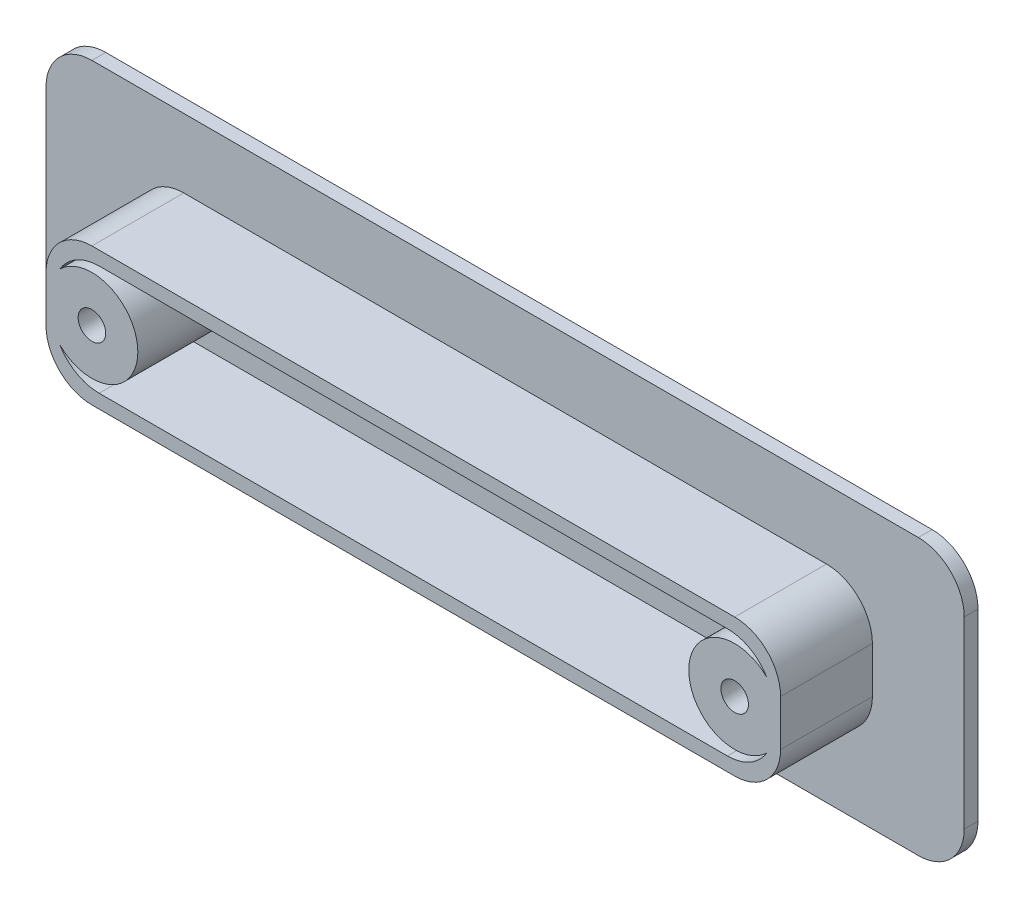
ISO-10303-21;
HEADER;
FILE_DESCRIPTION(('STEP AP214'),'2;1');
FILE_NAME('part.step','',(''),(''),'','','');
FILE_SCHEMA(('AUTOMOTIVE_DESIGN { 1 0 10303 214 1 1 1 1 }'));
ENDSEC;
DATA;
#1=APPLICATION_CONTEXT('core data for automotive mechanical design processes');
#2=APPLICATION_PROTOCOL_DEFINITION('international standard','automotive_design',2000,#1);
#3=PRODUCT_CONTEXT('',#1,'mechanical');
#4=PRODUCT('Part','Part','',(#3));
#5=PRODUCT_RELATED_PRODUCT_CATEGORY('part','',(#4));
#6=PRODUCT_DEFINITION_FORMATION('','',#4);
#7=PRODUCT_DEFINITION_CONTEXT('part definition',#1,'design');
#8=PRODUCT_DEFINITION('design','',#6,#7);
#9=PRODUCT_DEFINITION_SHAPE('','',#8);
#10=(LENGTH_UNIT() NAMED_UNIT(*) SI_UNIT(.MILLI.,.METRE.));
#11=(NAMED_UNIT(*) PLANE_ANGLE_UNIT() SI_UNIT($,.RADIAN.));
#12=(NAMED_UNIT(*) SI_UNIT($,.STERADIAN.) SOLID_ANGLE_UNIT());
#13=UNCERTAINTY_MEASURE_WITH_UNIT(LENGTH_MEASURE(1.E-05),#10,'distance_accuracy_value','');
#14=(GEOMETRIC_REPRESENTATION_CONTEXT(3) GLOBAL_UNCERTAINTY_ASSIGNED_CONTEXT((#13)) GLOBAL_UNIT_ASSIGNED_CONTEXT((#10,
#11,#12)) REPRESENTATION_CONTEXT('',''));
#15=CARTESIAN_POINT('',(0.,0.,0.));
#16=DIRECTION('',(0.,0.,1.));
#17=DIRECTION('',(1.,0.,0.));
#18=AXIS2_PLACEMENT_3D('',#15,#16,#17);
#19=CARTESIAN_POINT('',(0.,0.,1.5));
#20=DIRECTION('',(0.,0.,1.));
#21=DIRECTION('',(1.,0.,0.));
#22=AXIS2_PLACEMENT_3D('',#19,#20,#21);
#23=PLANE('',#22);
#24=DIRECTION('',(-1.,0.,0.));
#25=VECTOR('',#24,1.);
#26=CARTESIAN_POINT('',(-50.,15.,1.5));
#27=LINE('',#26,#25);
#28=CARTESIAN_POINT('',(45.,15.,1.5));
#29=VERTEX_POINT('',#28);
#30=CARTESIAN_POINT('',(-45.,15.,1.5));
#31=VERTEX_POINT('',#30);
#32=EDGE_CURVE('E300',#29,#31,#27,.T.);
#33=ORIENTED_EDGE('',*,*,#32,.T.);
#34=CARTESIAN_POINT('',(-45.,10.,1.5));
#35=DIRECTION('',(0.,0.,1.));
#36=DIRECTION('',(1.,0.,0.));
#37=AXIS2_PLACEMENT_3D('',#34,#35,#36);
#38=CIRCLE('',#37,5.);
#39=CARTESIAN_POINT('',(-50.,10.,1.5));
#40=VERTEX_POINT('',#39);
#41=EDGE_CURVE('E382',#31,#40,#38,.T.);
#42=ORIENTED_EDGE('',*,*,#41,.T.);
#43=DIRECTION('',(0.,-1.,0.));
#44=VECTOR('',#43,1.);
#45=CARTESIAN_POINT('',(-50.,15.,1.5));
#46=LINE('',#45,#44);
#47=CARTESIAN_POINT('',(-50.,-10.,1.5));
#48=VERTEX_POINT('',#47);
#49=EDGE_CURVE('E304',#40,#48,#46,.T.);
#50=ORIENTED_EDGE('',*,*,#49,.T.);
#51=CARTESIAN_POINT('',(-45.,-9.99999999999999,1.5));
#52=DIRECTION('',(0.,0.,1.));
#53=DIRECTION('',(1.,0.,0.));
#54=AXIS2_PLACEMENT_3D('',#51,#52,#53);
#55=CIRCLE('',#54,5.);
#56=CARTESIAN_POINT('',(-45.,-15.,1.5));
#57=VERTEX_POINT('',#56);
#58=EDGE_CURVE('E79',#48,#57,#55,.T.);
#59=ORIENTED_EDGE('',*,*,#58,.T.);
#60=DIRECTION('',(1.,0.,0.));
#61=VECTOR('',#60,1.);
#62=CARTESIAN_POINT('',(-50.,-15.,1.5));
#63=LINE('',#62,#61);
#64=CARTESIAN_POINT('',(45.,-15.,1.5));
#65=VERTEX_POINT('',#64);
#66=EDGE_CURVE('E306',#57,#65,#63,.T.);
#67=ORIENTED_EDGE('',*,*,#66,.T.);
#68=CARTESIAN_POINT('',(45.,-9.99999999999999,1.5));
#69=DIRECTION('',(0.,0.,1.));
#70=DIRECTION('',(1.,0.,0.));
#71=AXIS2_PLACEMENT_3D('',#68,#69,#70);
#72=CIRCLE('',#71,5.);
#73=CARTESIAN_POINT('',(50.,-9.99999999999999,1.5));
#74=VERTEX_POINT('',#73);
#75=EDGE_CURVE('E379',#65,#74,#72,.T.);
#76=ORIENTED_EDGE('',*,*,#75,.T.);
#77=DIRECTION('',(0.,1.,0.));
#78=VECTOR('',#77,1.);
#79=CARTESIAN_POINT('',(50.,15.,1.5));
#80=LINE('',#79,#78);
#81=CARTESIAN_POINT('',(50.,10.,1.5));
#82=VERTEX_POINT('',#81);
#83=EDGE_CURVE('E297',#74,#82,#80,.T.);
#84=ORIENTED_EDGE('',*,*,#83,.T.);
#85=CARTESIAN_POINT('',(45.,10.,1.5));
#86=DIRECTION('',(0.,0.,1.));
#87=DIRECTION('',(1.,0.,0.));
#88=AXIS2_PLACEMENT_3D('',#85,#86,#87);
#89=CIRCLE('',#88,5.);
#90=EDGE_CURVE('E377',#82,#29,#89,.T.);
#91=ORIENTED_EDGE('',*,*,#90,.T.);
#92=EDGE_LOOP('',(#33,#42,#50,#59,#67,#76,#84,#91));
#93=FACE_BOUND('',#92,.T.);
#94=DIRECTION('',(-1.,0.,0.));
#95=VECTOR('',#94,1.);
#96=CARTESIAN_POINT('',(-40.,7.5,1.5));
#97=LINE('',#96,#95);
#98=CARTESIAN_POINT('',(35.,7.5,1.5));
#99=VERTEX_POINT('',#98);
#100=CARTESIAN_POINT('',(-35.,7.5,1.5));
#101=VERTEX_POINT('',#100);
#102=EDGE_CURVE('E289',#99,#101,#97,.T.);
#103=ORIENTED_EDGE('',*,*,#102,.F.);
#104=CARTESIAN_POINT('',(35.,2.5,1.5));
#105=DIRECTION('',(0.,0.,1.));
#106=DIRECTION('',(1.,0.,0.));
#107=AXIS2_PLACEMENT_3D('',#104,#105,#106);
#108=CIRCLE('',#107,5.);
#109=CARTESIAN_POINT('',(40.,2.5,1.5));
#110=VERTEX_POINT('',#109);
#111=EDGE_CURVE('E400',#99,#110,#108,.F.);
#112=ORIENTED_EDGE('',*,*,#111,.T.);
#113=DIRECTION('',(0.,1.,0.));
#114=VECTOR('',#113,1.);
#115=CARTESIAN_POINT('',(40.,7.5,1.5));
#116=LINE('',#115,#114);
#117=CARTESIAN_POINT('',(40.,-2.5,1.5));
#118=VERTEX_POINT('',#117);
#119=EDGE_CURVE('E269',#118,#110,#116,.T.);
#120=ORIENTED_EDGE('',*,*,#119,.F.);
#121=CARTESIAN_POINT('',(35.,-2.5,1.5));
#122=DIRECTION('',(0.,0.,1.));
#123=DIRECTION('',(1.,0.,0.));
#124=AXIS2_PLACEMENT_3D('',#121,#122,#123);
#125=CIRCLE('',#124,5.);
#126=CARTESIAN_POINT('',(35.,-7.5,1.5));
#127=VERTEX_POINT('',#126);
#128=EDGE_CURVE('E402',#118,#127,#125,.F.);
#129=ORIENTED_EDGE('',*,*,#128,.T.);
#130=DIRECTION('',(1.,0.,0.));
#131=VECTOR('',#130,1.);
#132=CARTESIAN_POINT('',(-40.,-7.5,1.5));
#133=LINE('',#132,#131);
#134=CARTESIAN_POINT('',(-35.,-7.5,1.5));
#135=VERTEX_POINT('',#134);
#136=EDGE_CURVE('E277',#135,#127,#133,.T.);
#137=ORIENTED_EDGE('',*,*,#136,.F.);
#138=CARTESIAN_POINT('',(-35.,-2.5,1.5));
#139=DIRECTION('',(0.,0.,1.));
#140=DIRECTION('',(1.,0.,0.));
#141=AXIS2_PLACEMENT_3D('',#138,#139,#140);
#142=CIRCLE('',#141,5.);
#143=CARTESIAN_POINT('',(-40.,-2.5,1.5));
#144=VERTEX_POINT('',#143);
#145=EDGE_CURVE('E12',#135,#144,#142,.F.);
#146=ORIENTED_EDGE('',*,*,#145,.T.);
#147=DIRECTION('',(0.,-1.,0.));
#148=VECTOR('',#147,1.);
#149=CARTESIAN_POINT('',(-40.,7.5,1.5));
#150=LINE('',#149,#148);
#151=CARTESIAN_POINT('',(-40.,2.5,1.5));
#152=VERTEX_POINT('',#151);
#153=EDGE_CURVE('E292',#152,#144,#150,.T.);
#154=ORIENTED_EDGE('',*,*,#153,.F.);
#155=CARTESIAN_POINT('',(-35.,2.5,1.5));
#156=DIRECTION('',(0.,0.,1.));
#157=DIRECTION('',(1.,0.,0.));
#158=AXIS2_PLACEMENT_3D('',#155,#156,#157);
#159=CIRCLE('',#158,5.);
#160=EDGE_CURVE('E65',#152,#101,#159,.F.);
#161=ORIENTED_EDGE('',*,*,#160,.T.);
#162=EDGE_LOOP('',(#103,#112,#120,#129,#137,#146,#154,#161));
#163=FACE_BOUND('',#162,.T.);
#164=ADVANCED_FACE('F57',(#93,#163),#23,.T.);
#165=CARTESIAN_POINT('',(50.,15.,1.5));
#166=DIRECTION('',(-1.,0.,0.));
#167=DIRECTION('',(0.,0.,1.));
#168=AXIS2_PLACEMENT_3D('',#165,#166,#167);
#169=PLANE('',#168);
#170=ORIENTED_EDGE('',*,*,#83,.F.);
#171=DIRECTION('',(0.,0.,-1.));
#172=VECTOR('',#171,1.);
#173=CARTESIAN_POINT('',(50.,-9.99999999999999,1.5));
#174=LINE('',#173,#172);
#175=CARTESIAN_POINT('',(50.,-9.99999999999999,0.));
#176=VERTEX_POINT('',#175);
#177=EDGE_CURVE('E390',#74,#176,#174,.T.);
#178=ORIENTED_EDGE('',*,*,#177,.T.);
#179=DIRECTION('',(0.,1.,0.));
#180=VECTOR('',#179,1.);
#181=CARTESIAN_POINT('',(50.,15.,0.));
#182=LINE('',#181,#180);
#183=CARTESIAN_POINT('',(50.,10.,0.));
#184=VERTEX_POINT('',#183);
#185=EDGE_CURVE('E286',#176,#184,#182,.T.);
#186=ORIENTED_EDGE('',*,*,#185,.T.);
#187=DIRECTION('',(0.,0.,-1.));
#188=VECTOR('',#187,1.);
#189=CARTESIAN_POINT('',(50.,10.,1.5));
#190=LINE('',#189,#188);
#191=EDGE_CURVE('E388',#184,#82,#190,.F.);
#192=ORIENTED_EDGE('',*,*,#191,.T.);
#193=EDGE_LOOP('',(#170,#178,#186,#192));
#194=FACE_BOUND('',#193,.T.);
#195=ADVANCED_FACE('F454',(#194),#169,.F.);
#196=CARTESIAN_POINT('',(-50.,15.,1.5));
#197=DIRECTION('',(0.,-1.,0.));
#198=DIRECTION('',(0.,0.,-1.));
#199=AXIS2_PLACEMENT_3D('',#196,#197,#198);
#200=PLANE('',#199);
#201=DIRECTION('',(-1.,0.,0.));
#202=VECTOR('',#201,1.);
#203=CARTESIAN_POINT('',(-50.,15.,0.));
#204=LINE('',#203,#202);
#205=CARTESIAN_POINT('',(45.,15.,0.));
#206=VERTEX_POINT('',#205);
#207=CARTESIAN_POINT('',(-45.,15.,0.));
#208=VERTEX_POINT('',#207);
#209=EDGE_CURVE('E310',#206,#208,#204,.T.);
#210=ORIENTED_EDGE('',*,*,#209,.T.);
#211=DIRECTION('',(0.,0.,-1.));
#212=VECTOR('',#211,1.);
#213=CARTESIAN_POINT('',(-45.,15.,1.5));
#214=LINE('',#213,#212);
#215=EDGE_CURVE('E375',#208,#31,#214,.F.);
#216=ORIENTED_EDGE('',*,*,#215,.T.);
#217=ORIENTED_EDGE('',*,*,#32,.F.);
#218=DIRECTION('',(0.,0.,-1.));
#219=VECTOR('',#218,1.);
#220=CARTESIAN_POINT('',(45.,15.,1.5));
#221=LINE('',#220,#219);
#222=EDGE_CURVE('E372',#29,#206,#221,.T.);
#223=ORIENTED_EDGE('',*,*,#222,.T.);
#224=EDGE_LOOP('',(#210,#216,#217,#223));
#225=FACE_BOUND('',#224,.T.);
#226=ADVANCED_FACE('F460',(#225),#200,.F.);
#227=CARTESIAN_POINT('',(-50.,15.,1.5));
#228=DIRECTION('',(1.,0.,0.));
#229=DIRECTION('',(0.,1.,0.));
#230=AXIS2_PLACEMENT_3D('',#227,#228,#229);
#231=PLANE('',#230);
#232=ORIENTED_EDGE('',*,*,#49,.F.);
#233=DIRECTION('',(0.,0.,-1.));
#234=VECTOR('',#233,1.);
#235=CARTESIAN_POINT('',(-50.,10.,1.5));
#236=LINE('',#235,#234);
#237=CARTESIAN_POINT('',(-50.,10.,0.));
#238=VERTEX_POINT('',#237);
#239=EDGE_CURVE('E361',#40,#238,#236,.T.);
#240=ORIENTED_EDGE('',*,*,#239,.T.);
#241=DIRECTION('',(0.,-1.,0.));
#242=VECTOR('',#241,1.);
#243=CARTESIAN_POINT('',(-50.,15.,0.));
#244=LINE('',#243,#242);
#245=CARTESIAN_POINT('',(-50.,-10.,0.));
#246=VERTEX_POINT('',#245);
#247=EDGE_CURVE('E313',#238,#246,#244,.T.);
#248=ORIENTED_EDGE('',*,*,#247,.T.);
#249=DIRECTION('',(0.,0.,-1.));
#250=VECTOR('',#249,1.);
#251=CARTESIAN_POINT('',(-50.,-10.,1.5));
#252=LINE('',#251,#250);
#253=EDGE_CURVE('E359',#246,#48,#252,.F.);
#254=ORIENTED_EDGE('',*,*,#253,.T.);
#255=EDGE_LOOP('',(#232,#240,#248,#254));
#256=FACE_BOUND('',#255,.T.);
#257=ADVANCED_FACE('F677',(#256),#231,.F.);
#258=CARTESIAN_POINT('',(-50.,-15.,1.5));
#259=DIRECTION('',(0.,1.,0.));
#260=DIRECTION('',(0.,0.,1.));
#261=AXIS2_PLACEMENT_3D('',#258,#259,#260);
#262=PLANE('',#261);
#263=ORIENTED_EDGE('',*,*,#66,.F.);
#264=DIRECTION('',(0.,0.,-1.));
#265=VECTOR('',#264,1.);
#266=CARTESIAN_POINT('',(-45.,-15.,1.5));
#267=LINE('',#266,#265);
#268=CARTESIAN_POINT('',(-45.,-15.,0.));
#269=VERTEX_POINT('',#268);
#270=EDGE_CURVE('E385',#57,#269,#267,.T.);
#271=ORIENTED_EDGE('',*,*,#270,.T.);
#272=DIRECTION('',(1.,0.,0.));
#273=VECTOR('',#272,1.);
#274=CARTESIAN_POINT('',(-50.,-15.,0.));
#275=LINE('',#274,#273);
#276=CARTESIAN_POINT('',(45.,-15.,0.));
#277=VERTEX_POINT('',#276);
#278=EDGE_CURVE('E301',#269,#277,#275,.T.);
#279=ORIENTED_EDGE('',*,*,#278,.T.);
#280=DIRECTION('',(0.,0.,-1.));
#281=VECTOR('',#280,1.);
#282=CARTESIAN_POINT('',(45.,-15.,1.5));
#283=LINE('',#282,#281);
#284=EDGE_CURVE('E72',#277,#65,#283,.F.);
#285=ORIENTED_EDGE('',*,*,#284,.T.);
#286=EDGE_LOOP('',(#263,#271,#279,#285));
#287=FACE_BOUND('',#286,.T.);
#288=ADVANCED_FACE('F682',(#287),#262,.F.);
#289=CARTESIAN_POINT('',(0.,0.,0.));
#290=DIRECTION('',(0.,0.,1.));
#291=DIRECTION('',(1.,0.,0.));
#292=AXIS2_PLACEMENT_3D('',#289,#290,#291);
#293=PLANE('',#292);
#294=ORIENTED_EDGE('',*,*,#247,.F.);
#295=CARTESIAN_POINT('',(-45.,10.,0.));
#296=DIRECTION('',(0.,0.,1.));
#297=DIRECTION('',(1.,0.,0.));
#298=AXIS2_PLACEMENT_3D('',#295,#296,#297);
#299=CIRCLE('',#298,5.);
#300=EDGE_CURVE('E370',#238,#208,#299,.F.);
#301=ORIENTED_EDGE('',*,*,#300,.T.);
#302=ORIENTED_EDGE('',*,*,#209,.F.);
#303=CARTESIAN_POINT('',(45.,10.,0.));
#304=DIRECTION('',(0.,0.,1.));
#305=DIRECTION('',(1.,0.,0.));
#306=AXIS2_PLACEMENT_3D('',#303,#304,#305);
#307=CIRCLE('',#306,5.);
#308=EDGE_CURVE('E364',#206,#184,#307,.F.);
#309=ORIENTED_EDGE('',*,*,#308,.T.);
#310=ORIENTED_EDGE('',*,*,#185,.F.);
#311=CARTESIAN_POINT('',(45.,-9.99999999999999,0.));
#312=DIRECTION('',(0.,0.,1.));
#313=DIRECTION('',(1.,0.,0.));
#314=AXIS2_PLACEMENT_3D('',#311,#312,#313);
#315=CIRCLE('',#314,5.);
#316=EDGE_CURVE('E366',#176,#277,#315,.F.);
#317=ORIENTED_EDGE('',*,*,#316,.T.);
#318=ORIENTED_EDGE('',*,*,#278,.F.);
#319=CARTESIAN_POINT('',(-45.,-9.99999999999999,0.));
#320=DIRECTION('',(0.,0.,1.));
#321=DIRECTION('',(1.,0.,0.));
#322=AXIS2_PLACEMENT_3D('',#319,#320,#321);
#323=CIRCLE('',#322,5.);
#324=EDGE_CURVE('E368',#269,#246,#323,.F.);
#325=ORIENTED_EDGE('',*,*,#324,.T.);
#326=EDGE_LOOP('',(#294,#301,#302,#309,#310,#317,#318,#325));
#327=FACE_BOUND('',#326,.T.);
#328=ADVANCED_FACE('F486',(#327),#293,.F.);
#329=CARTESIAN_POINT('',(0.,0.,11.5));
#330=DIRECTION('',(0.,0.,1.));
#331=DIRECTION('',(1.,0.,0.));
#332=AXIS2_PLACEMENT_3D('',#329,#330,#331);
#333=PLANE('',#332);
#334=CARTESIAN_POINT('',(-35.,0.,11.5));
#335=DIRECTION('',(0.,0.,1.));
#336=DIRECTION('',(1.,0.,0.));
#337=AXIS2_PLACEMENT_3D('',#334,#335,#336);
#338=CIRCLE('',#337,1.5);
#339=CARTESIAN_POINT('',(-33.5,0.,11.5));
#340=VERTEX_POINT('',#339);
#341=EDGE_CURVE('E770',#340,#340,#338,.T.);
#342=ORIENTED_EDGE('',*,*,#341,.F.);
#343=EDGE_LOOP('',(#342));
#344=FACE_BOUND('',#343,.T.);
#345=CARTESIAN_POINT('',(35.,0.,11.5));
#346=DIRECTION('',(0.,0.,1.));
#347=DIRECTION('',(-1.,0.,0.));
#348=AXIS2_PLACEMENT_3D('',#345,#346,#347);
#349=CIRCLE('',#348,1.5);
#350=CARTESIAN_POINT('',(33.5,0.,11.5));
#351=VERTEX_POINT('',#350);
#352=EDGE_CURVE('E777',#351,#351,#349,.T.);
#353=ORIENTED_EDGE('',*,*,#352,.F.);
#354=EDGE_LOOP('',(#353));
#355=FACE_BOUND('',#354,.T.);
#356=CARTESIAN_POINT('',(35.,0.,11.5));
#357=DIRECTION('',(0.,0.,1.));
#358=DIRECTION('',(1.,0.,0.));
#359=AXIS2_PLACEMENT_3D('',#356,#357,#358);
#360=CIRCLE('',#359,5.);
#361=CARTESIAN_POINT('',(38.5,3.57071421427144,11.5));
#362=VERTEX_POINT('',#361);
#363=CARTESIAN_POINT('',(38.5,-3.57071421427144,11.5));
#364=VERTEX_POINT('',#363);
#365=EDGE_CURVE('E246',#362,#364,#360,.T.);
#366=ORIENTED_EDGE('',*,*,#365,.T.);
#367=CARTESIAN_POINT('',(34.2114771274315,-0.999999999999998,11.5));
#368=DIRECTION('',(0.,0.,1.));
#369=DIRECTION('',(1.,0.,0.));
#370=AXIS2_PLACEMENT_3D('',#367,#368,#369);
#371=CIRCLE('',#370,5.);
#372=CARTESIAN_POINT('',(34.2114771274315,-6.,11.5));
#373=VERTEX_POINT('',#372);
#374=EDGE_CURVE('E245',#364,#373,#371,.F.);
#375=ORIENTED_EDGE('',*,*,#374,.T.);
#376=DIRECTION('',(1.,0.,0.));
#377=VECTOR('',#376,1.);
#378=CARTESIAN_POINT('',(-40.,-6.,11.5));
#379=LINE('',#378,#377);
#380=CARTESIAN_POINT('',(-34.2114771274315,-6.,11.5));
#381=VERTEX_POINT('',#380);
#382=EDGE_CURVE('E266',#381,#373,#379,.T.);
#383=ORIENTED_EDGE('',*,*,#382,.F.);
#384=CARTESIAN_POINT('',(-34.2114771274315,-0.999999999999998,11.5));
#385=DIRECTION('',(0.,0.,1.));
#386=DIRECTION('',(1.,0.,0.));
#387=AXIS2_PLACEMENT_3D('',#384,#385,#386);
#388=CIRCLE('',#387,5.);
#389=CARTESIAN_POINT('',(-38.5,-3.57071421427142,11.5));
#390=VERTEX_POINT('',#389);
#391=EDGE_CURVE('E396',#381,#390,#388,.F.);
#392=ORIENTED_EDGE('',*,*,#391,.T.);
#393=CARTESIAN_POINT('',(-35.,0.,11.5));
#394=DIRECTION('',(0.,0.,1.));
#395=DIRECTION('',(1.,0.,0.));
#396=AXIS2_PLACEMENT_3D('',#393,#394,#395);
#397=CIRCLE('',#396,5.);
#398=CARTESIAN_POINT('',(-38.5,3.57071421427142,11.5));
#399=VERTEX_POINT('',#398);
#400=EDGE_CURVE('E248',#390,#399,#397,.T.);
#401=ORIENTED_EDGE('',*,*,#400,.T.);
#402=CARTESIAN_POINT('',(-34.2114771274315,1.,11.5));
#403=DIRECTION('',(0.,0.,1.));
#404=DIRECTION('',(1.,0.,0.));
#405=AXIS2_PLACEMENT_3D('',#402,#403,#404);
#406=CIRCLE('',#405,5.);
#407=CARTESIAN_POINT('',(-34.2114771274315,6.,11.5));
#408=VERTEX_POINT('',#407);
#409=EDGE_CURVE('E398',#399,#408,#406,.F.);
#410=ORIENTED_EDGE('',*,*,#409,.T.);
#411=DIRECTION('',(-1.,0.,0.));
#412=VECTOR('',#411,1.);
#413=CARTESIAN_POINT('',(-40.,6.,11.5));
#414=LINE('',#413,#412);
#415=CARTESIAN_POINT('',(34.2114771274315,6.,11.5));
#416=VERTEX_POINT('',#415);
#417=EDGE_CURVE('E263',#416,#408,#414,.T.);
#418=ORIENTED_EDGE('',*,*,#417,.F.);
#419=CARTESIAN_POINT('',(34.2114771274315,1.,11.5));
#420=DIRECTION('',(0.,0.,1.));
#421=DIRECTION('',(1.,0.,0.));
#422=AXIS2_PLACEMENT_3D('',#419,#420,#421);
#423=CIRCLE('',#422,5.);
#424=EDGE_CURVE('E394',#416,#362,#423,.F.);
#425=ORIENTED_EDGE('',*,*,#424,.T.);
#426=EDGE_LOOP('',(#366,#375,#383,#392,#401,#410,#418,#425));
#427=FACE_BOUND('',#426,.T.);
#428=DIRECTION('',(0.,1.,0.));
#429=VECTOR('',#428,1.);
#430=CARTESIAN_POINT('',(40.,7.5,11.5));
#431=LINE('',#430,#429);
#432=CARTESIAN_POINT('',(40.,-2.5,11.5));
#433=VERTEX_POINT('',#432);
#434=CARTESIAN_POINT('',(40.,2.5,11.5));
#435=VERTEX_POINT('',#434);
#436=EDGE_CURVE('E273',#433,#435,#431,.T.);
#437=ORIENTED_EDGE('',*,*,#436,.T.);
#438=CARTESIAN_POINT('',(35.,2.5,11.5));
#439=DIRECTION('',(0.,0.,1.));
#440=DIRECTION('',(1.,0.,0.));
#441=AXIS2_PLACEMENT_3D('',#438,#439,#440);
#442=CIRCLE('',#441,5.);
#443=CARTESIAN_POINT('',(35.,7.5,11.5));
#444=VERTEX_POINT('',#443);
#445=EDGE_CURVE('E347',#435,#444,#442,.T.);
#446=ORIENTED_EDGE('',*,*,#445,.T.);
#447=DIRECTION('',(-1.,0.,0.));
#448=VECTOR('',#447,1.);
#449=CARTESIAN_POINT('',(-40.,7.5,11.5));
#450=LINE('',#449,#448);
#451=CARTESIAN_POINT('',(-35.,7.5,11.5));
#452=VERTEX_POINT('',#451);
#453=EDGE_CURVE('E276',#444,#452,#450,.T.);
#454=ORIENTED_EDGE('',*,*,#453,.T.);
#455=CARTESIAN_POINT('',(-35.,2.5,11.5));
#456=DIRECTION('',(0.,0.,1.));
#457=DIRECTION('',(1.,0.,0.));
#458=AXIS2_PLACEMENT_3D('',#455,#456,#457);
#459=CIRCLE('',#458,5.);
#460=CARTESIAN_POINT('',(-40.,2.5,11.5));
#461=VERTEX_POINT('',#460);
#462=EDGE_CURVE('E343',#452,#461,#459,.T.);
#463=ORIENTED_EDGE('',*,*,#462,.T.);
#464=DIRECTION('',(0.,-1.,0.));
#465=VECTOR('',#464,1.);
#466=CARTESIAN_POINT('',(-40.,7.5,11.5));
#467=LINE('',#466,#465);
#468=CARTESIAN_POINT('',(-40.,-2.5,11.5));
#469=VERTEX_POINT('',#468);
#470=EDGE_CURVE('E280',#461,#469,#467,.T.);
#471=ORIENTED_EDGE('',*,*,#470,.T.);
#472=CARTESIAN_POINT('',(-35.,-2.5,11.5));
#473=DIRECTION('',(0.,0.,1.));
#474=DIRECTION('',(1.,0.,0.));
#475=AXIS2_PLACEMENT_3D('',#472,#473,#474);
#476=CIRCLE('',#475,5.);
#477=CARTESIAN_POINT('',(-35.,-7.5,11.5));
#478=VERTEX_POINT('',#477);
#479=EDGE_CURVE('E341',#469,#478,#476,.T.);
#480=ORIENTED_EDGE('',*,*,#479,.T.);
#481=DIRECTION('',(1.,0.,0.));
#482=VECTOR('',#481,1.);
#483=CARTESIAN_POINT('',(-40.,-7.5,11.5));
#484=LINE('',#483,#482);
#485=CARTESIAN_POINT('',(35.,-7.5,11.5));
#486=VERTEX_POINT('',#485);
#487=EDGE_CURVE('E283',#478,#486,#484,.T.);
#488=ORIENTED_EDGE('',*,*,#487,.T.);
#489=CARTESIAN_POINT('',(35.,-2.5,11.5));
#490=DIRECTION('',(0.,0.,1.));
#491=DIRECTION('',(1.,0.,0.));
#492=AXIS2_PLACEMENT_3D('',#489,#490,#491);
#493=CIRCLE('',#492,5.);
#494=EDGE_CURVE('E345',#486,#433,#493,.T.);
#495=ORIENTED_EDGE('',*,*,#494,.T.);
#496=EDGE_LOOP('',(#437,#446,#454,#463,#471,#480,#488,#495));
#497=FACE_BOUND('',#496,.T.);
#498=ADVANCED_FACE('F417',(#344,#355,#427,#497),#333,.T.);
#499=CARTESIAN_POINT('',(40.,7.5,11.5));
#500=DIRECTION('',(-1.,0.,0.));
#501=DIRECTION('',(0.,0.,1.));
#502=AXIS2_PLACEMENT_3D('',#499,#500,#501);
#503=PLANE('',#502);
#504=ORIENTED_EDGE('',*,*,#119,.T.);
#505=DIRECTION('',(0.,0.,-1.));
#506=VECTOR('',#505,1.);
#507=CARTESIAN_POINT('',(40.,2.5,11.5));
#508=LINE('',#507,#506);
#509=EDGE_CURVE('E339',#110,#435,#508,.F.);
#510=ORIENTED_EDGE('',*,*,#509,.T.);
#511=ORIENTED_EDGE('',*,*,#436,.F.);
#512=DIRECTION('',(0.,0.,-1.));
#513=VECTOR('',#512,1.);
#514=CARTESIAN_POINT('',(40.,-2.5,11.5));
#515=LINE('',#514,#513);
#516=EDGE_CURVE('E336',#433,#118,#515,.T.);
#517=ORIENTED_EDGE('',*,*,#516,.T.);
#518=EDGE_LOOP('',(#504,#510,#511,#517));
#519=FACE_BOUND('',#518,.T.);
#520=ADVANCED_FACE('F437',(#519),#503,.F.);
#521=CARTESIAN_POINT('',(-40.,7.5,11.5));
#522=DIRECTION('',(0.,-1.,0.));
#523=DIRECTION('',(0.,0.,-1.));
#524=AXIS2_PLACEMENT_3D('',#521,#522,#523);
#525=PLANE('',#524);
#526=ORIENTED_EDGE('',*,*,#453,.F.);
#527=DIRECTION('',(0.,0.,-1.));
#528=VECTOR('',#527,1.);
#529=CARTESIAN_POINT('',(35.,7.5,11.5));
#530=LINE('',#529,#528);
#531=EDGE_CURVE('E333',#444,#99,#530,.T.);
#532=ORIENTED_EDGE('',*,*,#531,.T.);
#533=ORIENTED_EDGE('',*,*,#102,.T.);
#534=DIRECTION('',(0.,0.,-1.));
#535=VECTOR('',#534,1.);
#536=CARTESIAN_POINT('',(-35.,7.5,11.5));
#537=LINE('',#536,#535);
#538=EDGE_CURVE('E331',#101,#452,#537,.F.);
#539=ORIENTED_EDGE('',*,*,#538,.T.);
#540=EDGE_LOOP('',(#526,#532,#533,#539));
#541=FACE_BOUND('',#540,.T.);
#542=ADVANCED_FACE('F411',(#541),#525,.F.);
#543=CARTESIAN_POINT('',(-40.,7.5,11.5));
#544=DIRECTION('',(1.,0.,0.));
#545=DIRECTION('',(0.,0.,-1.));
#546=AXIS2_PLACEMENT_3D('',#543,#544,#545);
#547=PLANE('',#546);
#548=ORIENTED_EDGE('',*,*,#470,.F.);
#549=DIRECTION('',(0.,0.,-1.));
#550=VECTOR('',#549,1.);
#551=CARTESIAN_POINT('',(-40.,2.5,11.5));
#552=LINE('',#551,#550);
#553=EDGE_CURVE('E356',#461,#152,#552,.T.);
#554=ORIENTED_EDGE('',*,*,#553,.T.);
#555=ORIENTED_EDGE('',*,*,#153,.T.);
#556=DIRECTION('',(0.,0.,-1.));
#557=VECTOR('',#556,1.);
#558=CARTESIAN_POINT('',(-40.,-2.5,11.5));
#559=LINE('',#558,#557);
#560=EDGE_CURVE('E354',#144,#469,#559,.F.);
#561=ORIENTED_EDGE('',*,*,#560,.T.);
#562=EDGE_LOOP('',(#548,#554,#555,#561));
#563=FACE_BOUND('',#562,.T.);
#564=ADVANCED_FACE('F420',(#563),#547,.F.);
#565=CARTESIAN_POINT('',(-40.,-7.5,11.5));
#566=DIRECTION('',(0.,1.,0.));
#567=DIRECTION('',(0.,0.,1.));
#568=AXIS2_PLACEMENT_3D('',#565,#566,#567);
#569=PLANE('',#568);
#570=ORIENTED_EDGE('',*,*,#136,.T.);
#571=DIRECTION('',(0.,0.,-1.));
#572=VECTOR('',#571,1.);
#573=CARTESIAN_POINT('',(35.,-7.5,11.5));
#574=LINE('',#573,#572);
#575=EDGE_CURVE('E352',#127,#486,#574,.F.);
#576=ORIENTED_EDGE('',*,*,#575,.T.);
#577=ORIENTED_EDGE('',*,*,#487,.F.);
#578=DIRECTION('',(0.,0.,-1.));
#579=VECTOR('',#578,1.);
#580=CARTESIAN_POINT('',(-35.,-7.5,11.5));
#581=LINE('',#580,#579);
#582=EDGE_CURVE('E349',#478,#135,#581,.T.);
#583=ORIENTED_EDGE('',*,*,#582,.T.);
#584=EDGE_LOOP('',(#570,#576,#577,#583));
#585=FACE_BOUND('',#584,.T.);
#586=ADVANCED_FACE('F428',(#585),#569,.F.);
#587=CARTESIAN_POINT('',(-40.,6.,11.5));
#588=DIRECTION('',(0.,-1.,0.));
#589=DIRECTION('',(0.,0.,-1.));
#590=AXIS2_PLACEMENT_3D('',#587,#588,#589);
#591=PLANE('',#590);
#592=DIRECTION('',(-1.,0.,0.));
#593=VECTOR('',#592,1.);
#594=CARTESIAN_POINT('',(-40.,6.,1.5));
#595=LINE('',#594,#593);
#596=CARTESIAN_POINT('',(34.2114771274315,6.,1.5));
#597=VERTEX_POINT('',#596);
#598=CARTESIAN_POINT('',(-34.2114771274315,6.,1.5));
#599=VERTEX_POINT('',#598);
#600=EDGE_CURVE('E262',#597,#599,#595,.T.);
#601=ORIENTED_EDGE('',*,*,#600,.F.);
#602=DIRECTION('',(0.,0.,1.));
#603=VECTOR('',#602,1.);
#604=CARTESIAN_POINT('',(34.2114771274315,6.,11.5));
#605=LINE('',#604,#603);
#606=EDGE_CURVE('E329',#597,#416,#605,.T.);
#607=ORIENTED_EDGE('',*,*,#606,.T.);
#608=ORIENTED_EDGE('',*,*,#417,.T.);
#609=DIRECTION('',(0.,0.,1.));
#610=VECTOR('',#609,1.);
#611=CARTESIAN_POINT('',(-34.2114771274315,6.,1.5));
#612=LINE('',#611,#610);
#613=EDGE_CURVE('E229',#408,#599,#612,.F.);
#614=ORIENTED_EDGE('',*,*,#613,.T.);
#615=EDGE_LOOP('',(#601,#607,#608,#614));
#616=FACE_BOUND('',#615,.T.);
#617=ADVANCED_FACE('F474',(#616),#591,.T.);
#618=CARTESIAN_POINT('',(-40.,-6.,11.5));
#619=DIRECTION('',(0.,1.,0.));
#620=DIRECTION('',(0.,0.,1.));
#621=AXIS2_PLACEMENT_3D('',#618,#619,#620);
#622=PLANE('',#621);
#623=ORIENTED_EDGE('',*,*,#382,.T.);
#624=DIRECTION('',(0.,0.,1.));
#625=VECTOR('',#624,1.);
#626=CARTESIAN_POINT('',(34.2114771274315,-6.,1.5));
#627=LINE('',#626,#625);
#628=CARTESIAN_POINT('',(34.2114771274315,-6.,1.5));
#629=VERTEX_POINT('',#628);
#630=EDGE_CURVE('E320',#373,#629,#627,.F.);
#631=ORIENTED_EDGE('',*,*,#630,.T.);
#632=DIRECTION('',(1.,0.,0.));
#633=VECTOR('',#632,1.);
#634=CARTESIAN_POINT('',(-40.,-6.,1.5));
#635=LINE('',#634,#633);
#636=CARTESIAN_POINT('',(-34.2114771274315,-6.,1.5));
#637=VERTEX_POINT('',#636);
#638=EDGE_CURVE('E224',#637,#629,#635,.T.);
#639=ORIENTED_EDGE('',*,*,#638,.F.);
#640=DIRECTION('',(0.,0.,1.));
#641=VECTOR('',#640,1.);
#642=CARTESIAN_POINT('',(-34.2114771274315,-6.,11.5));
#643=LINE('',#642,#641);
#644=EDGE_CURVE('E240',#637,#381,#643,.T.);
#645=ORIENTED_EDGE('',*,*,#644,.T.);
#646=EDGE_LOOP('',(#623,#631,#639,#645));
#647=FACE_BOUND('',#646,.T.);
#648=ADVANCED_FACE('F467',(#647),#622,.T.);
#649=ORIENTED_EDGE('',*,*,#638,.T.);
#650=CARTESIAN_POINT('',(34.2114771274315,-0.999999999999998,1.5));
#651=DIRECTION('',(0.,0.,1.));
#652=DIRECTION('',(1.,0.,0.));
#653=AXIS2_PLACEMENT_3D('',#650,#651,#652);
#654=CIRCLE('',#653,5.);
#655=CARTESIAN_POINT('',(38.5,-3.57071421427144,1.5));
#656=VERTEX_POINT('',#655);
#657=EDGE_CURVE('E219',#629,#656,#654,.T.);
#658=ORIENTED_EDGE('',*,*,#657,.T.);
#659=CARTESIAN_POINT('',(35.,0.,1.5));
#660=DIRECTION('',(0.,0.,1.));
#661=DIRECTION('',(1.,0.,0.));
#662=AXIS2_PLACEMENT_3D('',#659,#660,#661);
#663=CIRCLE('',#662,5.);
#664=CARTESIAN_POINT('',(38.5,3.57071421427144,1.5));
#665=VERTEX_POINT('',#664);
#666=EDGE_CURVE('E222',#656,#665,#663,.F.);
#667=ORIENTED_EDGE('',*,*,#666,.T.);
#668=CARTESIAN_POINT('',(34.2114771274315,1.,1.5));
#669=DIRECTION('',(0.,0.,1.));
#670=DIRECTION('',(1.,0.,0.));
#671=AXIS2_PLACEMENT_3D('',#668,#669,#670);
#672=CIRCLE('',#671,5.);
#673=EDGE_CURVE('E230',#665,#597,#672,.T.);
#674=ORIENTED_EDGE('',*,*,#673,.T.);
#675=ORIENTED_EDGE('',*,*,#600,.T.);
#676=CARTESIAN_POINT('',(-34.2114771274315,1.,1.5));
#677=DIRECTION('',(0.,0.,1.));
#678=DIRECTION('',(1.,0.,0.));
#679=AXIS2_PLACEMENT_3D('',#676,#677,#678);
#680=CIRCLE('',#679,5.);
#681=CARTESIAN_POINT('',(-38.5,3.57071421427142,1.5));
#682=VERTEX_POINT('',#681);
#683=EDGE_CURVE('E322',#599,#682,#680,.T.);
#684=ORIENTED_EDGE('',*,*,#683,.T.);
#685=CARTESIAN_POINT('',(-35.,0.,1.5));
#686=DIRECTION('',(0.,0.,1.));
#687=DIRECTION('',(1.,0.,0.));
#688=AXIS2_PLACEMENT_3D('',#685,#686,#687);
#689=CIRCLE('',#688,5.);
#690=CARTESIAN_POINT('',(-38.5,-3.57071421427142,1.5));
#691=VERTEX_POINT('',#690);
#692=EDGE_CURVE('E241',#682,#691,#689,.F.);
#693=ORIENTED_EDGE('',*,*,#692,.T.);
#694=CARTESIAN_POINT('',(-34.2114771274315,-0.999999999999998,1.5));
#695=DIRECTION('',(0.,0.,1.));
#696=DIRECTION('',(1.,0.,0.));
#697=AXIS2_PLACEMENT_3D('',#694,#695,#696);
#698=CIRCLE('',#697,5.);
#699=EDGE_CURVE('E324',#691,#637,#698,.T.);
#700=ORIENTED_EDGE('',*,*,#699,.T.);
#701=EDGE_LOOP('',(#649,#658,#667,#674,#675,#684,#693,#700));
#702=FACE_BOUND('',#701,.T.);
#703=ADVANCED_FACE('F221',(#702),#23,.T.);
#704=CARTESIAN_POINT('',(-35.,0.,25.642135623731));
#705=DIRECTION('',(0.,0.,-1.));
#706=DIRECTION('',(-1.,0.,0.));
#707=AXIS2_PLACEMENT_3D('',#704,#705,#706);
#708=CYLINDRICAL_SURFACE('',#707,5.);
#709=DIRECTION('',(0.,0.,-1.));
#710=VECTOR('',#709,1.);
#711=CARTESIAN_POINT('',(-38.5,-3.57071421427142,25.642135623731));
#712=LINE('',#711,#710);
#713=EDGE_CURVE('E259',#691,#390,#712,.F.);
#714=ORIENTED_EDGE('',*,*,#713,.F.);
#715=ORIENTED_EDGE('',*,*,#692,.F.);
#716=DIRECTION('',(0.,0.,-1.));
#717=VECTOR('',#716,1.);
#718=CARTESIAN_POINT('',(-38.5,3.57071421427142,25.642135623731));
#719=LINE('',#718,#717);
#720=EDGE_CURVE('E256',#399,#682,#719,.T.);
#721=ORIENTED_EDGE('',*,*,#720,.F.);
#722=ORIENTED_EDGE('',*,*,#400,.F.);
#723=EDGE_LOOP('',(#714,#715,#721,#722));
#724=FACE_BOUND('',#723,.T.);
#725=ADVANCED_FACE('F466',(#724),#708,.T.);
#726=CARTESIAN_POINT('',(35.,0.,25.642135623731));
#727=DIRECTION('',(0.,0.,-1.));
#728=DIRECTION('',(-1.,0.,0.));
#729=AXIS2_PLACEMENT_3D('',#726,#727,#728);
#730=CYLINDRICAL_SURFACE('',#729,5.);
#731=DIRECTION('',(0.,0.,-1.));
#732=VECTOR('',#731,1.);
#733=CARTESIAN_POINT('',(38.5,3.57071421427144,25.642135623731));
#734=LINE('',#733,#732);
#735=EDGE_CURVE('E239',#665,#362,#734,.F.);
#736=ORIENTED_EDGE('',*,*,#735,.F.);
#737=ORIENTED_EDGE('',*,*,#666,.F.);
#738=DIRECTION('',(0.,0.,-1.));
#739=VECTOR('',#738,1.);
#740=CARTESIAN_POINT('',(38.5,-3.57071421427144,25.642135623731));
#741=LINE('',#740,#739);
#742=EDGE_CURVE('E236',#364,#656,#741,.T.);
#743=ORIENTED_EDGE('',*,*,#742,.F.);
#744=ORIENTED_EDGE('',*,*,#365,.F.);
#745=EDGE_LOOP('',(#736,#737,#743,#744));
#746=FACE_BOUND('',#745,.T.);
#747=ADVANCED_FACE('F234',(#746),#730,.T.);
#748=CARTESIAN_POINT('',(35.,0.,1.5));
#749=DIRECTION('',(0.,0.,1.));
#750=DIRECTION('',(1.,0.,0.));
#751=AXIS2_PLACEMENT_3D('',#748,#749,#750);
#752=CYLINDRICAL_SURFACE('',#751,1.5);
#753=CARTESIAN_POINT('',(35.,0.,1.5));
#754=DIRECTION('',(0.,0.,1.));
#755=DIRECTION('',(-1.,0.,0.));
#756=AXIS2_PLACEMENT_3D('',#753,#754,#755);
#757=CIRCLE('',#756,1.5);
#758=CARTESIAN_POINT('',(33.5,0.,1.5));
#759=VERTEX_POINT('',#758);
#760=EDGE_CURVE('E773',#759,#759,#757,.T.);
#761=ORIENTED_EDGE('',*,*,#760,.F.);
#762=EDGE_LOOP('',(#761));
#763=FACE_BOUND('',#762,.T.);
#764=ORIENTED_EDGE('',*,*,#352,.T.);
#765=EDGE_LOOP('',(#764));
#766=FACE_BOUND('',#765,.T.);
#767=ADVANCED_FACE('F542',(#763,#766),#752,.F.);
#768=CARTESIAN_POINT('',(35.,0.,1.5));
#769=DIRECTION('',(0.,0.,-1.));
#770=DIRECTION('',(-1.,0.,0.));
#771=AXIS2_PLACEMENT_3D('',#768,#769,#770);
#772=PLANE('',#771);
#773=ORIENTED_EDGE('',*,*,#760,.T.);
#774=EDGE_LOOP('',(#773));
#775=FACE_BOUND('',#774,.T.);
#776=ADVANCED_FACE('F551',(#775),#772,.F.);
#777=CARTESIAN_POINT('',(-35.,0.,1.5));
#778=DIRECTION('',(0.,0.,1.));
#779=DIRECTION('',(1.,0.,0.));
#780=AXIS2_PLACEMENT_3D('',#777,#778,#779);
#781=CYLINDRICAL_SURFACE('',#780,1.5);
#782=CARTESIAN_POINT('',(-35.,0.,1.5));
#783=DIRECTION('',(0.,0.,1.));
#784=DIRECTION('',(1.,0.,0.));
#785=AXIS2_PLACEMENT_3D('',#782,#783,#784);
#786=CIRCLE('',#785,1.5);
#787=CARTESIAN_POINT('',(-33.5,0.,1.5));
#788=VERTEX_POINT('',#787);
#789=EDGE_CURVE('E250',#788,#788,#786,.T.);
#790=ORIENTED_EDGE('',*,*,#789,.F.);
#791=EDGE_LOOP('',(#790));
#792=FACE_BOUND('',#791,.T.);
#793=ORIENTED_EDGE('',*,*,#341,.T.);
#794=EDGE_LOOP('',(#793));
#795=FACE_BOUND('',#794,.T.);
#796=ADVANCED_FACE('F558',(#792,#795),#781,.F.);
#797=CARTESIAN_POINT('',(-35.,0.,1.5));
#798=DIRECTION('',(0.,0.,1.));
#799=DIRECTION('',(1.,0.,0.));
#800=AXIS2_PLACEMENT_3D('',#797,#798,#799);
#801=PLANE('',#800);
#802=ORIENTED_EDGE('',*,*,#789,.T.);
#803=EDGE_LOOP('',(#802));
#804=FACE_BOUND('',#803,.T.);
#805=ADVANCED_FACE('F566',(#804),#801,.T.);
#806=CARTESIAN_POINT('',(34.2114771274315,-0.999999999999998,25.642135623731));
#807=DIRECTION('',(0.,0.,-1.));
#808=DIRECTION('',(-1.,0.,0.));
#809=AXIS2_PLACEMENT_3D('',#806,#807,#808);
#810=CYLINDRICAL_SURFACE('',#809,5.);
#811=ORIENTED_EDGE('',*,*,#374,.F.);
#812=ORIENTED_EDGE('',*,*,#742,.T.);
#813=ORIENTED_EDGE('',*,*,#657,.F.);
#814=ORIENTED_EDGE('',*,*,#630,.F.);
#815=EDGE_LOOP('',(#811,#812,#813,#814));
#816=FACE_BOUND('',#815,.T.);
#817=ADVANCED_FACE('F244',(#816),#810,.F.);
#818=CARTESIAN_POINT('',(34.2114771274315,1.,25.642135623731));
#819=DIRECTION('',(0.,0.,-1.));
#820=DIRECTION('',(-1.,0.,0.));
#821=AXIS2_PLACEMENT_3D('',#818,#819,#820);
#822=CYLINDRICAL_SURFACE('',#821,5.);
#823=ORIENTED_EDGE('',*,*,#424,.F.);
#824=ORIENTED_EDGE('',*,*,#606,.F.);
#825=ORIENTED_EDGE('',*,*,#673,.F.);
#826=ORIENTED_EDGE('',*,*,#735,.T.);
#827=EDGE_LOOP('',(#823,#824,#825,#826));
#828=FACE_BOUND('',#827,.T.);
#829=ADVANCED_FACE('F579',(#828),#822,.F.);
#830=CARTESIAN_POINT('',(-34.2114771274315,-0.999999999999998,25.642135623731));
#831=DIRECTION('',(0.,0.,-1.));
#832=DIRECTION('',(-1.,0.,0.));
#833=AXIS2_PLACEMENT_3D('',#830,#831,#832);
#834=CYLINDRICAL_SURFACE('',#833,5.);
#835=ORIENTED_EDGE('',*,*,#391,.F.);
#836=ORIENTED_EDGE('',*,*,#644,.F.);
#837=ORIENTED_EDGE('',*,*,#699,.F.);
#838=ORIENTED_EDGE('',*,*,#713,.T.);
#839=EDGE_LOOP('',(#835,#836,#837,#838));
#840=FACE_BOUND('',#839,.T.);
#841=ADVANCED_FACE('F450',(#840),#834,.F.);
#842=CARTESIAN_POINT('',(-34.2114771274315,1.,25.642135623731));
#843=DIRECTION('',(0.,0.,-1.));
#844=DIRECTION('',(-1.,0.,0.));
#845=AXIS2_PLACEMENT_3D('',#842,#843,#844);
#846=CYLINDRICAL_SURFACE('',#845,5.);
#847=ORIENTED_EDGE('',*,*,#409,.F.);
#848=ORIENTED_EDGE('',*,*,#720,.T.);
#849=ORIENTED_EDGE('',*,*,#683,.F.);
#850=ORIENTED_EDGE('',*,*,#613,.F.);
#851=EDGE_LOOP('',(#847,#848,#849,#850));
#852=FACE_BOUND('',#851,.T.);
#853=ADVANCED_FACE('F443',(#852),#846,.F.);
#854=CARTESIAN_POINT('',(35.,2.5,11.5));
#855=DIRECTION('',(0.,0.,-1.));
#856=DIRECTION('',(-1.,0.,0.));
#857=AXIS2_PLACEMENT_3D('',#854,#855,#856);
#858=CYLINDRICAL_SURFACE('',#857,5.);
#859=ORIENTED_EDGE('',*,*,#445,.F.);
#860=ORIENTED_EDGE('',*,*,#509,.F.);
#861=ORIENTED_EDGE('',*,*,#111,.F.);
#862=ORIENTED_EDGE('',*,*,#531,.F.);
#863=EDGE_LOOP('',(#859,#860,#861,#862));
#864=FACE_BOUND('',#863,.T.);
#865=ADVANCED_FACE('F441',(#864),#858,.T.);
#866=CARTESIAN_POINT('',(35.,-2.5,11.5));
#867=DIRECTION('',(0.,0.,-1.));
#868=DIRECTION('',(-1.,0.,0.));
#869=AXIS2_PLACEMENT_3D('',#866,#867,#868);
#870=CYLINDRICAL_SURFACE('',#869,5.);
#871=ORIENTED_EDGE('',*,*,#494,.F.);
#872=ORIENTED_EDGE('',*,*,#575,.F.);
#873=ORIENTED_EDGE('',*,*,#128,.F.);
#874=ORIENTED_EDGE('',*,*,#516,.F.);
#875=EDGE_LOOP('',(#871,#872,#873,#874));
#876=FACE_BOUND('',#875,.T.);
#877=ADVANCED_FACE('F432',(#876),#870,.T.);
#878=CARTESIAN_POINT('',(-35.,2.5,11.5));
#879=DIRECTION('',(0.,0.,-1.));
#880=DIRECTION('',(-1.,0.,0.));
#881=AXIS2_PLACEMENT_3D('',#878,#879,#880);
#882=CYLINDRICAL_SURFACE('',#881,5.);
#883=ORIENTED_EDGE('',*,*,#462,.F.);
#884=ORIENTED_EDGE('',*,*,#538,.F.);
#885=ORIENTED_EDGE('',*,*,#160,.F.);
#886=ORIENTED_EDGE('',*,*,#553,.F.);
#887=EDGE_LOOP('',(#883,#884,#885,#886));
#888=FACE_BOUND('',#887,.T.);
#889=ADVANCED_FACE('F414',(#888),#882,.T.);
#890=CARTESIAN_POINT('',(-35.,-2.5,11.5));
#891=DIRECTION('',(0.,0.,-1.));
#892=DIRECTION('',(-1.,0.,0.));
#893=AXIS2_PLACEMENT_3D('',#890,#891,#892);
#894=CYLINDRICAL_SURFACE('',#893,5.);
#895=ORIENTED_EDGE('',*,*,#479,.F.);
#896=ORIENTED_EDGE('',*,*,#560,.F.);
#897=ORIENTED_EDGE('',*,*,#145,.F.);
#898=ORIENTED_EDGE('',*,*,#582,.F.);
#899=EDGE_LOOP('',(#895,#896,#897,#898));
#900=FACE_BOUND('',#899,.T.);
#901=ADVANCED_FACE('F423',(#900),#894,.T.);
#902=CARTESIAN_POINT('',(-45.,10.,1.5));
#903=DIRECTION('',(0.,0.,-1.));
#904=DIRECTION('',(-1.,0.,0.));
#905=AXIS2_PLACEMENT_3D('',#902,#903,#904);
#906=CYLINDRICAL_SURFACE('',#905,5.);
#907=ORIENTED_EDGE('',*,*,#41,.F.);
#908=ORIENTED_EDGE('',*,*,#215,.F.);
#909=ORIENTED_EDGE('',*,*,#300,.F.);
#910=ORIENTED_EDGE('',*,*,#239,.F.);
#911=EDGE_LOOP('',(#907,#908,#909,#910));
#912=FACE_BOUND('',#911,.T.);
#913=ADVANCED_FACE('F625',(#912),#906,.T.);
#914=CARTESIAN_POINT('',(-45.,-9.99999999999999,1.5));
#915=DIRECTION('',(0.,0.,-1.));
#916=DIRECTION('',(-1.,0.,0.));
#917=AXIS2_PLACEMENT_3D('',#914,#915,#916);
#918=CYLINDRICAL_SURFACE('',#917,5.);
#919=ORIENTED_EDGE('',*,*,#58,.F.);
#920=ORIENTED_EDGE('',*,*,#253,.F.);
#921=ORIENTED_EDGE('',*,*,#324,.F.);
#922=ORIENTED_EDGE('',*,*,#270,.F.);
#923=EDGE_LOOP('',(#919,#920,#921,#922));
#924=FACE_BOUND('',#923,.T.);
#925=ADVANCED_FACE('F634',(#924),#918,.T.);
#926=CARTESIAN_POINT('',(45.,-9.99999999999999,1.5));
#927=DIRECTION('',(0.,0.,-1.));
#928=DIRECTION('',(-1.,0.,0.));
#929=AXIS2_PLACEMENT_3D('',#926,#927,#928);
#930=CYLINDRICAL_SURFACE('',#929,5.);
#931=ORIENTED_EDGE('',*,*,#75,.F.);
#932=ORIENTED_EDGE('',*,*,#284,.F.);
#933=ORIENTED_EDGE('',*,*,#316,.F.);
#934=ORIENTED_EDGE('',*,*,#177,.F.);
#935=EDGE_LOOP('',(#931,#932,#933,#934));
#936=FACE_BOUND('',#935,.T.);
#937=ADVANCED_FACE('F644',(#936),#930,.T.);
#938=CARTESIAN_POINT('',(45.,10.,1.5));
#939=DIRECTION('',(0.,0.,-1.));
#940=DIRECTION('',(-1.,0.,0.));
#941=AXIS2_PLACEMENT_3D('',#938,#939,#940);
#942=CYLINDRICAL_SURFACE('',#941,5.);
#943=ORIENTED_EDGE('',*,*,#90,.F.);
#944=ORIENTED_EDGE('',*,*,#191,.F.);
#945=ORIENTED_EDGE('',*,*,#308,.F.);
#946=ORIENTED_EDGE('',*,*,#222,.F.);
#947=EDGE_LOOP('',(#943,#944,#945,#946));
#948=FACE_BOUND('',#947,.T.);
#949=ADVANCED_FACE('F59',(#948),#942,.T.);
#950=CLOSED_SHELL('',(#164,#195,#226,#257,#288,#328,#498,#520,#542,#564,#586,#617,#648,#703,
#725,#747,#767,#776,#796,#805,#817,#829,#841,#853,#865,#877,#889,#901,#913,#925,#937,#949));
#951=MANIFOLD_SOLID_BREP('B2',#950);
#952=ADVANCED_BREP_SHAPE_REPRESENTATION('',(#18,#951),#14);
#953=SHAPE_DEFINITION_REPRESENTATION(#9,#952);
ENDSEC;
END-ISO-10303-21;
